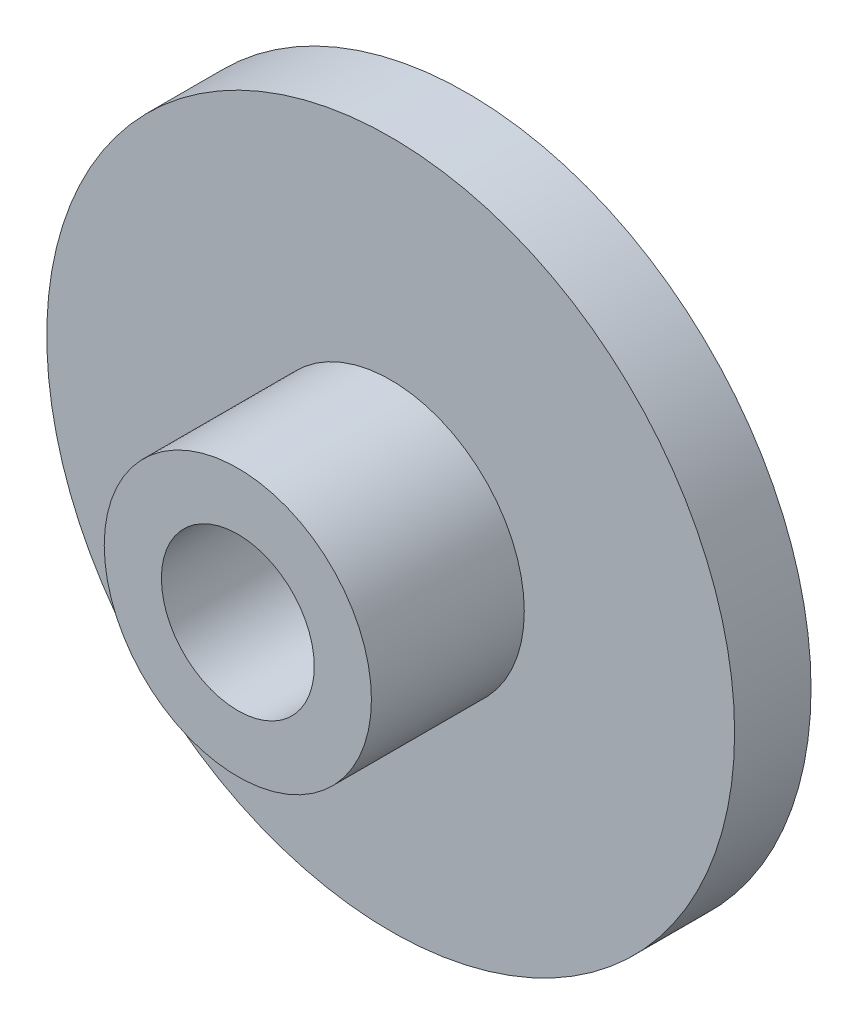
ISO-10303-21;
HEADER;
FILE_DESCRIPTION(('STEP AP214'),'2;1');
FILE_NAME('part.step','',(''),(''),'','','');
FILE_SCHEMA(('AUTOMOTIVE_DESIGN { 1 0 10303 214 1 1 1 1 }'));
ENDSEC;
DATA;
#1=APPLICATION_CONTEXT('core data for automotive mechanical design processes');
#2=APPLICATION_PROTOCOL_DEFINITION('international standard','automotive_design',2000,#1);
#3=PRODUCT_CONTEXT('',#1,'mechanical');
#4=PRODUCT('Part','Part','',(#3));
#5=PRODUCT_RELATED_PRODUCT_CATEGORY('part','',(#4));
#6=PRODUCT_DEFINITION_FORMATION('','',#4);
#7=PRODUCT_DEFINITION_CONTEXT('part definition',#1,'design');
#8=PRODUCT_DEFINITION('design','',#6,#7);
#9=PRODUCT_DEFINITION_SHAPE('','',#8);
#10=(LENGTH_UNIT() NAMED_UNIT(*) SI_UNIT(.MILLI.,.METRE.));
#11=(NAMED_UNIT(*) PLANE_ANGLE_UNIT() SI_UNIT($,.RADIAN.));
#12=(NAMED_UNIT(*) SI_UNIT($,.STERADIAN.) SOLID_ANGLE_UNIT());
#13=UNCERTAINTY_MEASURE_WITH_UNIT(LENGTH_MEASURE(1.E-05),#10,'distance_accuracy_value','');
#14=(GEOMETRIC_REPRESENTATION_CONTEXT(3) GLOBAL_UNCERTAINTY_ASSIGNED_CONTEXT((#13)) GLOBAL_UNIT_ASSIGNED_CONTEXT((#10,
#11,#12)) REPRESENTATION_CONTEXT('',''));
#15=CARTESIAN_POINT('',(0.,0.,0.));
#16=DIRECTION('',(0.,0.,1.));
#17=DIRECTION('',(1.,0.,0.));
#18=AXIS2_PLACEMENT_3D('',#15,#16,#17);
#19=CARTESIAN_POINT('',(0.,0.,3.175));
#20=DIRECTION('',(0.,0.,-1.));
#21=DIRECTION('',(-1.,0.,0.));
#22=AXIS2_PLACEMENT_3D('',#19,#20,#21);
#23=CYLINDRICAL_SURFACE('',#22,14.2875);
#24=CARTESIAN_POINT('',(0.,0.,3.175));
#25=DIRECTION('',(0.,0.,1.));
#26=DIRECTION('',(1.,0.,0.));
#27=AXIS2_PLACEMENT_3D('',#24,#25,#26);
#28=CIRCLE('',#27,14.2875);
#29=CARTESIAN_POINT('',(14.2875,0.,3.175));
#30=VERTEX_POINT('',#29);
#31=EDGE_CURVE('E12',#30,#30,#28,.T.);
#32=ORIENTED_EDGE('',*,*,#31,.F.);
#33=EDGE_LOOP('',(#32));
#34=FACE_BOUND('',#33,.T.);
#35=CARTESIAN_POINT('',(0.,0.,0.));
#36=DIRECTION('',(0.,0.,1.));
#37=DIRECTION('',(1.,0.,0.));
#38=AXIS2_PLACEMENT_3D('',#35,#36,#37);
#39=CIRCLE('',#38,14.2875);
#40=CARTESIAN_POINT('',(14.2875,0.,0.));
#41=VERTEX_POINT('',#40);
#42=EDGE_CURVE('E49',#41,#41,#39,.T.);
#43=ORIENTED_EDGE('',*,*,#42,.T.);
#44=EDGE_LOOP('',(#43));
#45=FACE_BOUND('',#44,.T.);
#46=ADVANCED_FACE('F42',(#34,#45),#23,.T.);
#47=CARTESIAN_POINT('',(0.,0.,3.175));
#48=DIRECTION('',(0.,0.,1.));
#49=DIRECTION('',(1.,0.,0.));
#50=AXIS2_PLACEMENT_3D('',#47,#48,#49);
#51=PLANE('',#50);
#52=CARTESIAN_POINT('',(0.,0.,3.175));
#53=DIRECTION('',(0.,0.,1.));
#54=DIRECTION('',(1.,0.,0.));
#55=AXIS2_PLACEMENT_3D('',#52,#53,#54);
#56=CIRCLE('',#55,5.5499);
#57=CARTESIAN_POINT('',(5.5499,0.,3.175));
#58=VERTEX_POINT('',#57);
#59=EDGE_CURVE('E56',#58,#58,#56,.T.);
#60=ORIENTED_EDGE('',*,*,#59,.F.);
#61=EDGE_LOOP('',(#60));
#62=FACE_BOUND('',#61,.T.);
#63=ORIENTED_EDGE('',*,*,#31,.T.);
#64=EDGE_LOOP('',(#63));
#65=FACE_BOUND('',#64,.T.);
#66=ADVANCED_FACE('F83',(#62,#65),#51,.T.);
#67=CARTESIAN_POINT('',(0.,0.,0.));
#68=DIRECTION('',(0.,0.,1.));
#69=DIRECTION('',(1.,0.,0.));
#70=AXIS2_PLACEMENT_3D('',#67,#68,#69);
#71=PLANE('',#70);
#72=CARTESIAN_POINT('',(0.,0.,0.));
#73=DIRECTION('',(0.,0.,-1.));
#74=DIRECTION('',(-1.,0.,0.));
#75=AXIS2_PLACEMENT_3D('',#72,#73,#74);
#76=CIRCLE('',#75,3.175);
#77=CARTESIAN_POINT('',(-3.175,0.,0.));
#78=VERTEX_POINT('',#77);
#79=EDGE_CURVE('E61',#78,#78,#76,.T.);
#80=ORIENTED_EDGE('',*,*,#79,.F.);
#81=EDGE_LOOP('',(#80));
#82=FACE_BOUND('',#81,.T.);
#83=ORIENTED_EDGE('',*,*,#42,.F.);
#84=EDGE_LOOP('',(#83));
#85=FACE_BOUND('',#84,.T.);
#86=ADVANCED_FACE('F79',(#82,#85),#71,.F.);
#87=CARTESIAN_POINT('',(0.,0.,9.525));
#88=DIRECTION('',(0.,0.,-1.));
#89=DIRECTION('',(-1.,0.,0.));
#90=AXIS2_PLACEMENT_3D('',#87,#88,#89);
#91=CYLINDRICAL_SURFACE('',#90,5.5499);
#92=CARTESIAN_POINT('',(0.,0.,9.525));
#93=DIRECTION('',(0.,0.,1.));
#94=DIRECTION('',(1.,0.,0.));
#95=AXIS2_PLACEMENT_3D('',#92,#93,#94);
#96=CIRCLE('',#95,5.5499);
#97=CARTESIAN_POINT('',(5.5499,0.,9.525));
#98=VERTEX_POINT('',#97);
#99=EDGE_CURVE('E54',#98,#98,#96,.T.);
#100=ORIENTED_EDGE('',*,*,#99,.F.);
#101=EDGE_LOOP('',(#100));
#102=FACE_BOUND('',#101,.T.);
#103=ORIENTED_EDGE('',*,*,#59,.T.);
#104=EDGE_LOOP('',(#103));
#105=FACE_BOUND('',#104,.T.);
#106=ADVANCED_FACE('F73',(#102,#105),#91,.T.);
#107=CARTESIAN_POINT('',(0.,0.,9.525));
#108=DIRECTION('',(0.,0.,1.));
#109=DIRECTION('',(1.,0.,0.));
#110=AXIS2_PLACEMENT_3D('',#107,#108,#109);
#111=PLANE('',#110);
#112=CARTESIAN_POINT('',(0.,0.,9.525));
#113=DIRECTION('',(0.,0.,1.));
#114=DIRECTION('',(1.,0.,0.));
#115=AXIS2_PLACEMENT_3D('',#112,#113,#114);
#116=CIRCLE('',#115,3.175);
#117=CARTESIAN_POINT('',(3.175,0.,9.525));
#118=VERTEX_POINT('',#117);
#119=EDGE_CURVE('E45',#118,#118,#116,.T.);
#120=ORIENTED_EDGE('',*,*,#119,.F.);
#121=EDGE_LOOP('',(#120));
#122=FACE_BOUND('',#121,.T.);
#123=ORIENTED_EDGE('',*,*,#99,.T.);
#124=EDGE_LOOP('',(#123));
#125=FACE_BOUND('',#124,.T.);
#126=ADVANCED_FACE('F70',(#122,#125),#111,.T.);
#127=CARTESIAN_POINT('',(0.,0.,11.43));
#128=DIRECTION('',(0.,0.,-1.));
#129=DIRECTION('',(-1.,0.,0.));
#130=AXIS2_PLACEMENT_3D('',#127,#128,#129);
#131=CYLINDRICAL_SURFACE('',#130,3.175);
#132=ORIENTED_EDGE('',*,*,#119,.T.);
#133=EDGE_LOOP('',(#132));
#134=FACE_BOUND('',#133,.T.);
#135=ORIENTED_EDGE('',*,*,#79,.T.);
#136=EDGE_LOOP('',(#135));
#137=FACE_BOUND('',#136,.T.);
#138=ADVANCED_FACE('F68',(#134,#137),#131,.F.);
#139=CLOSED_SHELL('',(#46,#66,#86,#106,#126,#138));
#140=MANIFOLD_SOLID_BREP('B2',#139);
#141=ADVANCED_BREP_SHAPE_REPRESENTATION('',(#18,#140),#14);
#142=SHAPE_DEFINITION_REPRESENTATION(#9,#141);
ENDSEC;
END-ISO-10303-21;
